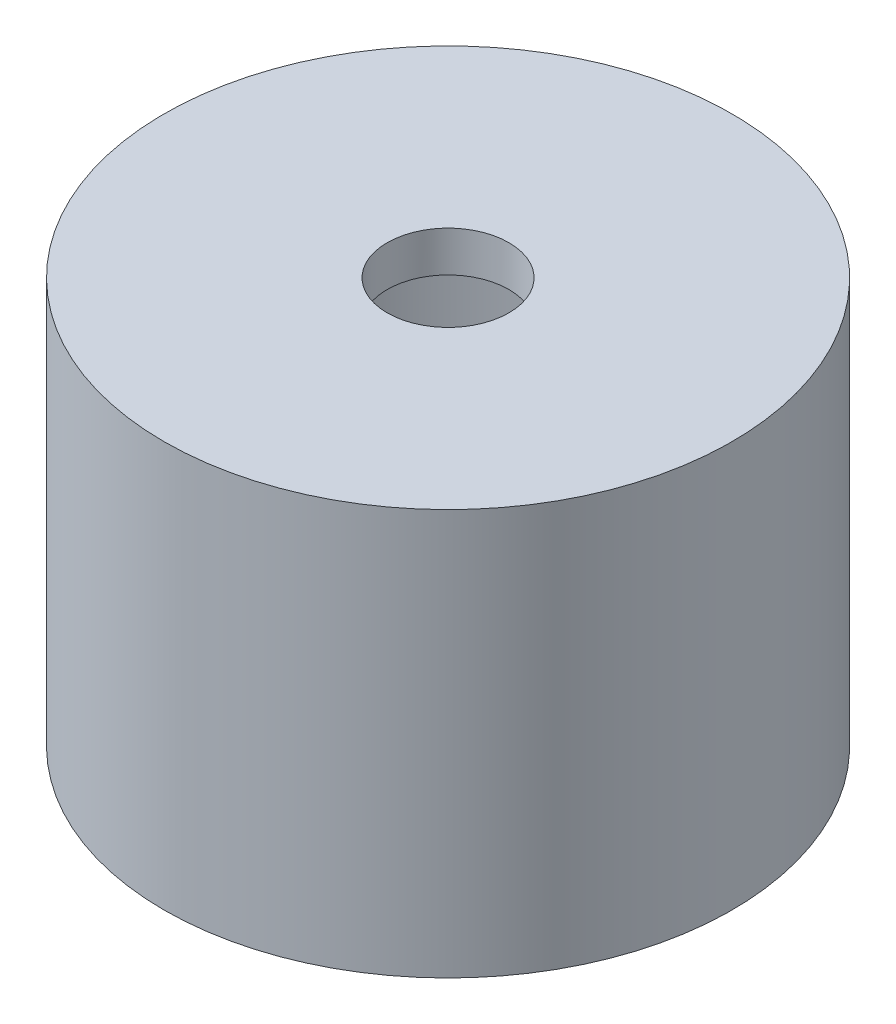
ISO-10303-21;
HEADER;
FILE_DESCRIPTION(('STEP AP214'),'2;1');
FILE_NAME('part.step','',(''),(''),'','','');
FILE_SCHEMA(('AUTOMOTIVE_DESIGN { 1 0 10303 214 1 1 1 1 }'));
ENDSEC;
DATA;
#1=APPLICATION_CONTEXT('core data for automotive mechanical design processes');
#2=APPLICATION_PROTOCOL_DEFINITION('international standard','automotive_design',2000,#1);
#3=PRODUCT_CONTEXT('',#1,'mechanical');
#4=PRODUCT('Part','Part','',(#3));
#5=PRODUCT_RELATED_PRODUCT_CATEGORY('part','',(#4));
#6=PRODUCT_DEFINITION_FORMATION('','',#4);
#7=PRODUCT_DEFINITION_CONTEXT('part definition',#1,'design');
#8=PRODUCT_DEFINITION('design','',#6,#7);
#9=PRODUCT_DEFINITION_SHAPE('','',#8);
#10=(LENGTH_UNIT() NAMED_UNIT(*) SI_UNIT(.MILLI.,.METRE.));
#11=(NAMED_UNIT(*) PLANE_ANGLE_UNIT() SI_UNIT($,.RADIAN.));
#12=(NAMED_UNIT(*) SI_UNIT($,.STERADIAN.) SOLID_ANGLE_UNIT());
#13=UNCERTAINTY_MEASURE_WITH_UNIT(LENGTH_MEASURE(1.E-05),#10,'distance_accuracy_value','');
#14=(GEOMETRIC_REPRESENTATION_CONTEXT(3) GLOBAL_UNCERTAINTY_ASSIGNED_CONTEXT((#13)) GLOBAL_UNIT_ASSIGNED_CONTEXT((#10,
#11,#12)) REPRESENTATION_CONTEXT('',''));
#15=CARTESIAN_POINT('',(0.,0.,0.));
#16=DIRECTION('',(0.,0.,1.));
#17=DIRECTION('',(1.,0.,0.));
#18=AXIS2_PLACEMENT_3D('',#15,#16,#17);
#19=CARTESIAN_POINT('',(0.,10.,0.));
#20=DIRECTION('',(0.,-1.,0.));
#21=DIRECTION('',(0.,0.,-1.));
#22=AXIS2_PLACEMENT_3D('',#19,#20,#21);
#23=CYLINDRICAL_SURFACE('',#22,7.);
#24=CARTESIAN_POINT('',(0.,10.,0.));
#25=DIRECTION('',(0.,1.,0.));
#26=DIRECTION('',(0.,0.,1.));
#27=AXIS2_PLACEMENT_3D('',#24,#25,#26);
#28=CIRCLE('',#27,7.);
#29=CARTESIAN_POINT('',(0.,10.,7.));
#30=VERTEX_POINT('',#29);
#31=EDGE_CURVE('E10',#30,#30,#28,.T.);
#32=ORIENTED_EDGE('',*,*,#31,.F.);
#33=EDGE_LOOP('',(#32));
#34=FACE_BOUND('',#33,.T.);
#35=CARTESIAN_POINT('',(0.,0.,0.));
#36=DIRECTION('',(0.,1.,0.));
#37=DIRECTION('',(0.,0.,1.));
#38=AXIS2_PLACEMENT_3D('',#35,#36,#37);
#39=CIRCLE('',#38,7.);
#40=CARTESIAN_POINT('',(0.,0.,7.));
#41=VERTEX_POINT('',#40);
#42=EDGE_CURVE('E34',#41,#41,#39,.T.);
#43=ORIENTED_EDGE('',*,*,#42,.T.);
#44=EDGE_LOOP('',(#43));
#45=FACE_BOUND('',#44,.T.);
#46=ADVANCED_FACE('F31',(#34,#45),#23,.T.);
#47=CARTESIAN_POINT('',(0.,10.,0.));
#48=DIRECTION('',(0.,1.,0.));
#49=DIRECTION('',(0.,0.,1.));
#50=AXIS2_PLACEMENT_3D('',#47,#48,#49);
#51=PLANE('',#50);
#52=CARTESIAN_POINT('',(0.,10.,0.));
#53=DIRECTION('',(0.,1.,0.));
#54=DIRECTION('',(0.,0.,1.));
#55=AXIS2_PLACEMENT_3D('',#52,#53,#54);
#56=CIRCLE('',#55,1.5);
#57=CARTESIAN_POINT('',(0.,10.,1.5));
#58=VERTEX_POINT('',#57);
#59=EDGE_CURVE('E46',#58,#58,#56,.T.);
#60=ORIENTED_EDGE('',*,*,#59,.F.);
#61=EDGE_LOOP('',(#60));
#62=FACE_BOUND('',#61,.T.);
#63=ORIENTED_EDGE('',*,*,#31,.T.);
#64=EDGE_LOOP('',(#63));
#65=FACE_BOUND('',#64,.T.);
#66=ADVANCED_FACE('F72',(#62,#65),#51,.T.);
#67=CARTESIAN_POINT('',(0.,0.,0.));
#68=DIRECTION('',(0.,1.,0.));
#69=DIRECTION('',(0.,0.,1.));
#70=AXIS2_PLACEMENT_3D('',#67,#68,#69);
#71=PLANE('',#70);
#72=CARTESIAN_POINT('',(0.,0.,0.));
#73=DIRECTION('',(0.,1.,0.));
#74=DIRECTION('',(0.,0.,1.));
#75=AXIS2_PLACEMENT_3D('',#72,#73,#74);
#76=CIRCLE('',#75,6.);
#77=CARTESIAN_POINT('',(0.,0.,6.));
#78=VERTEX_POINT('',#77);
#79=EDGE_CURVE('E43',#78,#78,#76,.T.);
#80=ORIENTED_EDGE('',*,*,#79,.T.);
#81=EDGE_LOOP('',(#80));
#82=FACE_BOUND('',#81,.T.);
#83=ORIENTED_EDGE('',*,*,#42,.F.);
#84=EDGE_LOOP('',(#83));
#85=FACE_BOUND('',#84,.T.);
#86=ADVANCED_FACE('F66',(#82,#85),#71,.F.);
#87=CARTESIAN_POINT('',(0.,10.,0.));
#88=DIRECTION('',(0.,-1.,0.));
#89=DIRECTION('',(0.,0.,-1.));
#90=AXIS2_PLACEMENT_3D('',#87,#88,#89);
#91=CYLINDRICAL_SURFACE('',#90,6.);
#92=CARTESIAN_POINT('',(0.,9.,0.));
#93=DIRECTION('',(0.,1.,0.));
#94=DIRECTION('',(0.,0.,1.));
#95=AXIS2_PLACEMENT_3D('',#92,#93,#94);
#96=CIRCLE('',#95,6.);
#97=CARTESIAN_POINT('',(0.,9.,6.));
#98=VERTEX_POINT('',#97);
#99=EDGE_CURVE('E41',#98,#98,#96,.T.);
#100=ORIENTED_EDGE('',*,*,#99,.T.);
#101=EDGE_LOOP('',(#100));
#102=FACE_BOUND('',#101,.T.);
#103=ORIENTED_EDGE('',*,*,#79,.F.);
#104=EDGE_LOOP('',(#103));
#105=FACE_BOUND('',#104,.T.);
#106=ADVANCED_FACE('F60',(#102,#105),#91,.F.);
#107=CARTESIAN_POINT('',(0.,9.,0.));
#108=DIRECTION('',(0.,1.,0.));
#109=DIRECTION('',(0.,0.,1.));
#110=AXIS2_PLACEMENT_3D('',#107,#108,#109);
#111=PLANE('',#110);
#112=CARTESIAN_POINT('',(0.,9.,0.));
#113=DIRECTION('',(0.,-1.,0.));
#114=DIRECTION('',(0.,0.,-1.));
#115=AXIS2_PLACEMENT_3D('',#112,#113,#114);
#116=CIRCLE('',#115,1.5);
#117=CARTESIAN_POINT('',(0.,9.,-1.5));
#118=VERTEX_POINT('',#117);
#119=EDGE_CURVE('E51',#118,#118,#116,.T.);
#120=ORIENTED_EDGE('',*,*,#119,.F.);
#121=EDGE_LOOP('',(#120));
#122=FACE_BOUND('',#121,.T.);
#123=ORIENTED_EDGE('',*,*,#99,.F.);
#124=EDGE_LOOP('',(#123));
#125=FACE_BOUND('',#124,.T.);
#126=ADVANCED_FACE('F57',(#122,#125),#111,.F.);
#127=CARTESIAN_POINT('',(0.,19.,0.));
#128=DIRECTION('',(0.,-1.,0.));
#129=DIRECTION('',(0.,0.,-1.));
#130=AXIS2_PLACEMENT_3D('',#127,#128,#129);
#131=CYLINDRICAL_SURFACE('',#130,1.5);
#132=ORIENTED_EDGE('',*,*,#59,.T.);
#133=EDGE_LOOP('',(#132));
#134=FACE_BOUND('',#133,.T.);
#135=ORIENTED_EDGE('',*,*,#119,.T.);
#136=EDGE_LOOP('',(#135));
#137=FACE_BOUND('',#136,.T.);
#138=ADVANCED_FACE('F55',(#134,#137),#131,.F.);
#139=CLOSED_SHELL('',(#46,#66,#86,#106,#126,#138));
#140=MANIFOLD_SOLID_BREP('B2',#139);
#141=ADVANCED_BREP_SHAPE_REPRESENTATION('',(#18,#140),#14);
#142=SHAPE_DEFINITION_REPRESENTATION(#9,#141);
ENDSEC;
END-ISO-10303-21;
